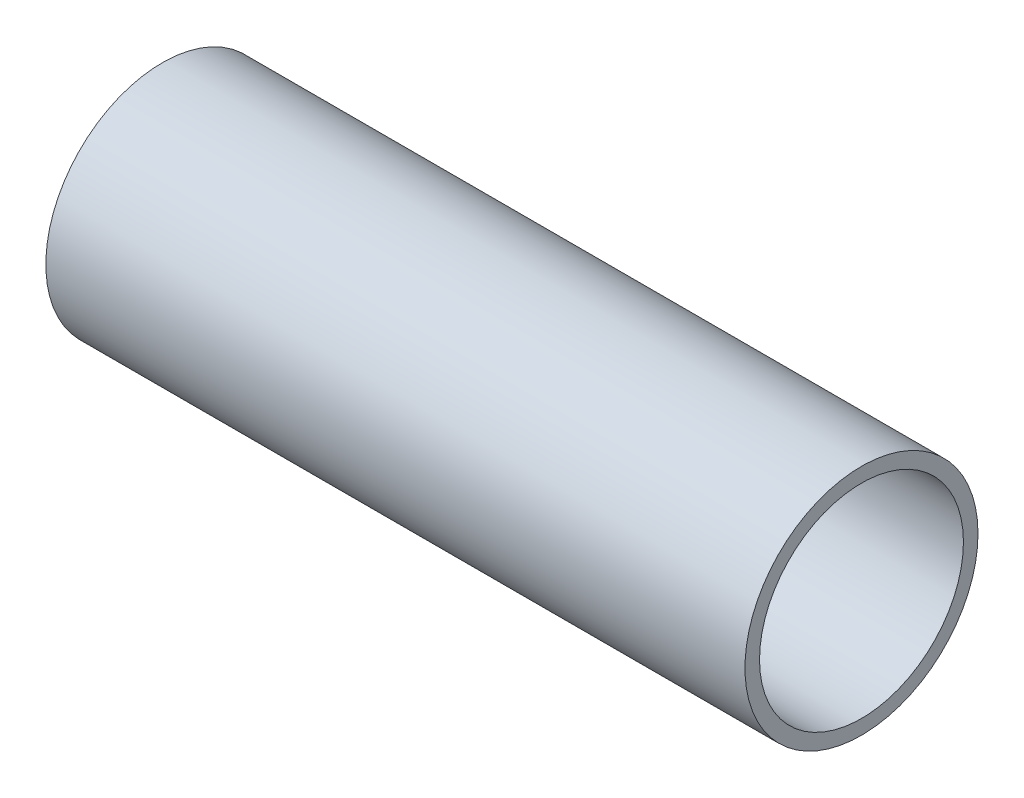
ISO-10303-21;
HEADER;
FILE_DESCRIPTION(('STEP AP214'),'2;1');
FILE_NAME('part.step','',(''),(''),'','','');
FILE_SCHEMA(('AUTOMOTIVE_DESIGN { 1 0 10303 214 1 1 1 1 }'));
ENDSEC;
DATA;
#1=APPLICATION_CONTEXT('core data for automotive mechanical design processes');
#2=APPLICATION_PROTOCOL_DEFINITION('international standard','automotive_design',2000,#1);
#3=PRODUCT_CONTEXT('',#1,'mechanical');
#4=PRODUCT('Part','Part','',(#3));
#5=PRODUCT_RELATED_PRODUCT_CATEGORY('part','',(#4));
#6=PRODUCT_DEFINITION_FORMATION('','',#4);
#7=PRODUCT_DEFINITION_CONTEXT('part definition',#1,'design');
#8=PRODUCT_DEFINITION('design','',#6,#7);
#9=PRODUCT_DEFINITION_SHAPE('','',#8);
#10=(LENGTH_UNIT() NAMED_UNIT(*) SI_UNIT(.MILLI.,.METRE.));
#11=(NAMED_UNIT(*) PLANE_ANGLE_UNIT() SI_UNIT($,.RADIAN.));
#12=(NAMED_UNIT(*) SI_UNIT($,.STERADIAN.) SOLID_ANGLE_UNIT());
#13=UNCERTAINTY_MEASURE_WITH_UNIT(LENGTH_MEASURE(1.E-05),#10,'distance_accuracy_value','');
#14=(GEOMETRIC_REPRESENTATION_CONTEXT(3) GLOBAL_UNCERTAINTY_ASSIGNED_CONTEXT((#13)) GLOBAL_UNIT_ASSIGNED_CONTEXT((#10,
#11,#12)) REPRESENTATION_CONTEXT('',''));
#15=CARTESIAN_POINT('',(0.,0.,0.));
#16=DIRECTION('',(0.,0.,1.));
#17=DIRECTION('',(1.,0.,0.));
#18=AXIS2_PLACEMENT_3D('',#15,#16,#17);
#19=CARTESIAN_POINT('',(152.4,0.,0.));
#20=DIRECTION('',(1.,0.,0.));
#21=DIRECTION('',(0.,0.,-1.));
#22=AXIS2_PLACEMENT_3D('',#19,#20,#21);
#23=PLANE('',#22);
#24=CARTESIAN_POINT('',(152.4,0.,0.));
#25=DIRECTION('',(1.,0.,0.));
#26=DIRECTION('',(0.,0.,-1.));
#27=AXIS2_PLACEMENT_3D('',#24,#25,#26);
#28=CIRCLE('',#27,25.4);
#29=CARTESIAN_POINT('',(152.4,0.,-25.4));
#30=VERTEX_POINT('',#29);
#31=EDGE_CURVE('E10',#30,#30,#28,.T.);
#32=ORIENTED_EDGE('',*,*,#31,.T.);
#33=EDGE_LOOP('',(#32));
#34=FACE_BOUND('',#33,.T.);
#35=CARTESIAN_POINT('',(152.4,0.,0.));
#36=DIRECTION('',(1.,0.,0.));
#37=DIRECTION('',(0.,0.,-1.));
#38=AXIS2_PLACEMENT_3D('',#35,#36,#37);
#39=CIRCLE('',#38,22.225);
#40=CARTESIAN_POINT('',(152.4,0.,-22.225));
#41=VERTEX_POINT('',#40);
#42=EDGE_CURVE('E50',#41,#41,#39,.T.);
#43=ORIENTED_EDGE('',*,*,#42,.F.);
#44=EDGE_LOOP('',(#43));
#45=FACE_BOUND('',#44,.T.);
#46=ADVANCED_FACE('F37',(#34,#45),#23,.T.);
#47=CARTESIAN_POINT('',(0.,0.,0.));
#48=DIRECTION('',(1.,0.,0.));
#49=DIRECTION('',(0.,0.,-1.));
#50=AXIS2_PLACEMENT_3D('',#47,#48,#49);
#51=PLANE('',#50);
#52=CARTESIAN_POINT('',(0.,0.,0.));
#53=DIRECTION('',(1.,0.,0.));
#54=DIRECTION('',(0.,0.,-1.));
#55=AXIS2_PLACEMENT_3D('',#52,#53,#54);
#56=CIRCLE('',#55,25.4);
#57=CARTESIAN_POINT('',(0.,0.,-25.4));
#58=VERTEX_POINT('',#57);
#59=EDGE_CURVE('E41',#58,#58,#56,.T.);
#60=ORIENTED_EDGE('',*,*,#59,.F.);
#61=EDGE_LOOP('',(#60));
#62=FACE_BOUND('',#61,.T.);
#63=CARTESIAN_POINT('',(0.,0.,0.));
#64=DIRECTION('',(1.,0.,0.));
#65=DIRECTION('',(0.,0.,-1.));
#66=AXIS2_PLACEMENT_3D('',#63,#64,#65);
#67=CIRCLE('',#66,22.225);
#68=CARTESIAN_POINT('',(0.,0.,-22.225));
#69=VERTEX_POINT('',#68);
#70=EDGE_CURVE('E52',#69,#69,#67,.T.);
#71=ORIENTED_EDGE('',*,*,#70,.T.);
#72=EDGE_LOOP('',(#71));
#73=FACE_BOUND('',#72,.T.);
#74=ADVANCED_FACE('F64',(#62,#73),#51,.F.);
#75=CARTESIAN_POINT('',(152.4,0.,0.));
#76=DIRECTION('',(-1.,0.,0.));
#77=DIRECTION('',(0.,0.,1.));
#78=AXIS2_PLACEMENT_3D('',#75,#76,#77);
#79=CYLINDRICAL_SURFACE('',#78,25.4);
#80=ORIENTED_EDGE('',*,*,#31,.F.);
#81=EDGE_LOOP('',(#80));
#82=FACE_BOUND('',#81,.T.);
#83=ORIENTED_EDGE('',*,*,#59,.T.);
#84=EDGE_LOOP('',(#83));
#85=FACE_BOUND('',#84,.T.);
#86=ADVANCED_FACE('F39',(#82,#85),#79,.T.);
#87=CARTESIAN_POINT('',(152.4,0.,0.));
#88=DIRECTION('',(-1.,0.,0.));
#89=DIRECTION('',(0.,0.,1.));
#90=AXIS2_PLACEMENT_3D('',#87,#88,#89);
#91=CYLINDRICAL_SURFACE('',#90,22.225);
#92=ORIENTED_EDGE('',*,*,#42,.T.);
#93=EDGE_LOOP('',(#92));
#94=FACE_BOUND('',#93,.T.);
#95=ORIENTED_EDGE('',*,*,#70,.F.);
#96=EDGE_LOOP('',(#95));
#97=FACE_BOUND('',#96,.T.);
#98=ADVANCED_FACE('F60',(#94,#97),#91,.F.);
#99=CLOSED_SHELL('',(#46,#74,#86,#98));
#100=MANIFOLD_SOLID_BREP('B2',#99);
#101=ADVANCED_BREP_SHAPE_REPRESENTATION('',(#18,#100),#14);
#102=SHAPE_DEFINITION_REPRESENTATION(#9,#101);
ENDSEC;
END-ISO-10303-21;
